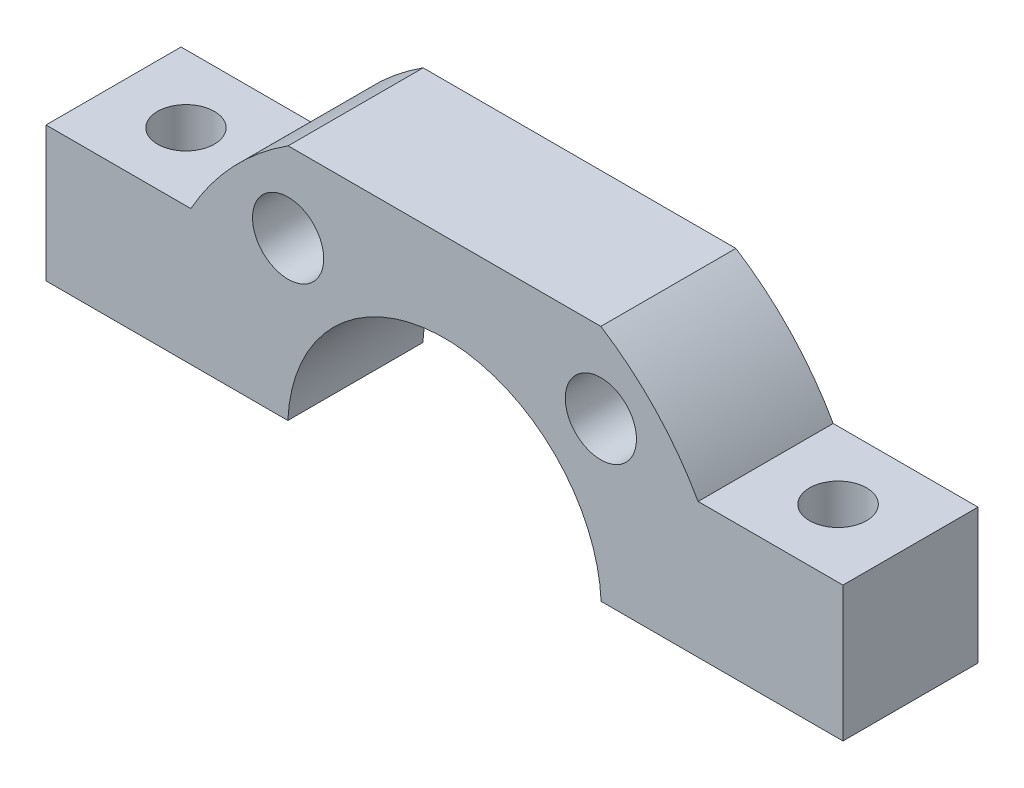
ISO-10303-21;
HEADER;
FILE_DESCRIPTION(('STEP AP214'),'2;1');
FILE_NAME('part.step','',(''),(''),'','','');
FILE_SCHEMA(('AUTOMOTIVE_DESIGN { 1 0 10303 214 1 1 1 1 }'));
ENDSEC;
DATA;
#1=APPLICATION_CONTEXT('core data for automotive mechanical design processes');
#2=APPLICATION_PROTOCOL_DEFINITION('international standard','automotive_design',2000,#1);
#3=PRODUCT_CONTEXT('',#1,'mechanical');
#4=PRODUCT('Part','Part','',(#3));
#5=PRODUCT_RELATED_PRODUCT_CATEGORY('part','',(#4));
#6=PRODUCT_DEFINITION_FORMATION('','',#4);
#7=PRODUCT_DEFINITION_CONTEXT('part definition',#1,'design');
#8=PRODUCT_DEFINITION('design','',#6,#7);
#9=PRODUCT_DEFINITION_SHAPE('','',#8);
#10=(LENGTH_UNIT() NAMED_UNIT(*) SI_UNIT(.MILLI.,.METRE.));
#11=(NAMED_UNIT(*) PLANE_ANGLE_UNIT() SI_UNIT($,.RADIAN.));
#12=(NAMED_UNIT(*) SI_UNIT($,.STERADIAN.) SOLID_ANGLE_UNIT());
#13=UNCERTAINTY_MEASURE_WITH_UNIT(LENGTH_MEASURE(1.E-05),#10,'distance_accuracy_value','');
#14=(GEOMETRIC_REPRESENTATION_CONTEXT(3) GLOBAL_UNCERTAINTY_ASSIGNED_CONTEXT((#13)) GLOBAL_UNIT_ASSIGNED_CONTEXT((#10,
#11,#12)) REPRESENTATION_CONTEXT('',''));
#15=CARTESIAN_POINT('',(0.,0.,0.));
#16=DIRECTION('',(0.,0.,1.));
#17=DIRECTION('',(1.,0.,0.));
#18=AXIS2_PLACEMENT_3D('',#15,#16,#17);
#19=CARTESIAN_POINT('',(0.,0.,9.5));
#20=DIRECTION('',(0.,0.,1.));
#21=DIRECTION('',(1.,0.,0.));
#22=AXIS2_PLACEMENT_3D('',#19,#20,#21);
#23=PLANE('',#22);
#24=CARTESIAN_POINT('',(11.,11.6189500386223,9.5));
#25=DIRECTION('',(0.,0.,1.));
#26=DIRECTION('',(1.,0.,0.));
#27=AXIS2_PLACEMENT_3D('',#24,#25,#26);
#28=CIRCLE('',#27,2.505);
#29=CARTESIAN_POINT('',(13.505,11.6189500386223,9.5));
#30=VERTEX_POINT('',#29);
#31=EDGE_CURVE('E191',#30,#30,#28,.T.);
#32=ORIENTED_EDGE('',*,*,#31,.F.);
#33=EDGE_LOOP('',(#32));
#34=FACE_BOUND('',#33,.T.);
#35=CARTESIAN_POINT('',(-11.,11.6189500386223,9.5));
#36=DIRECTION('',(0.,0.,1.));
#37=DIRECTION('',(1.,0.,0.));
#38=AXIS2_PLACEMENT_3D('',#35,#36,#37);
#39=CIRCLE('',#38,2.505);
#40=CARTESIAN_POINT('',(-8.495,11.6189500386223,9.5));
#41=VERTEX_POINT('',#40);
#42=EDGE_CURVE('E251',#41,#41,#39,.T.);
#43=ORIENTED_EDGE('',*,*,#42,.F.);
#44=EDGE_LOOP('',(#43));
#45=FACE_BOUND('',#44,.T.);
#46=DIRECTION('',(0.,-1.,0.));
#47=VECTOR('',#46,1.);
#48=CARTESIAN_POINT('',(-28.03,0.,9.5));
#49=LINE('',#48,#47);
#50=CARTESIAN_POINT('',(-28.03,10.,9.5));
#51=VERTEX_POINT('',#50);
#52=CARTESIAN_POINT('',(-28.03,0.5,9.5));
#53=VERTEX_POINT('',#52);
#54=EDGE_CURVE('E143',#51,#53,#49,.T.);
#55=ORIENTED_EDGE('',*,*,#54,.T.);
#56=DIRECTION('',(1.,0.,0.));
#57=VECTOR('',#56,1.);
#58=CARTESIAN_POINT('',(0.,0.5,9.5));
#59=LINE('',#58,#57);
#60=CARTESIAN_POINT('',(-11.0186614432062,0.5,9.5));
#61=VERTEX_POINT('',#60);
#62=EDGE_CURVE('E56',#53,#61,#59,.T.);
#63=ORIENTED_EDGE('',*,*,#62,.T.);
#64=CARTESIAN_POINT('',(0.,0.,9.5));
#65=DIRECTION('',(0.,0.,-1.));
#66=DIRECTION('',(1.,0.,0.));
#67=AXIS2_PLACEMENT_3D('',#64,#65,#66);
#68=CIRCLE('',#67,11.03);
#69=CARTESIAN_POINT('',(11.0186614432062,0.5,9.5));
#70=VERTEX_POINT('',#69);
#71=EDGE_CURVE('E131',#61,#70,#68,.T.);
#72=ORIENTED_EDGE('',*,*,#71,.T.);
#73=CARTESIAN_POINT('',(28.03,0.5,9.5));
#74=VERTEX_POINT('',#73);
#75=EDGE_CURVE('E247',#70,#74,#59,.T.);
#76=ORIENTED_EDGE('',*,*,#75,.T.);
#77=DIRECTION('',(0.,1.,0.));
#78=VECTOR('',#77,1.);
#79=CARTESIAN_POINT('',(28.03,0.,9.5));
#80=LINE('',#79,#78);
#81=CARTESIAN_POINT('',(28.03,10.,9.5));
#82=VERTEX_POINT('',#81);
#83=EDGE_CURVE('E135',#74,#82,#80,.T.);
#84=ORIENTED_EDGE('',*,*,#83,.T.);
#85=DIRECTION('',(-1.,0.,0.));
#86=VECTOR('',#85,1.);
#87=CARTESIAN_POINT('',(28.03,10.,9.5));
#88=LINE('',#87,#86);
#89=CARTESIAN_POINT('',(17.8428878183517,10.,9.5));
#90=VERTEX_POINT('',#89);
#91=EDGE_CURVE('E198',#82,#90,#88,.T.);
#92=ORIENTED_EDGE('',*,*,#91,.T.);
#93=CARTESIAN_POINT('',(0.,0.,9.5));
#94=DIRECTION('',(0.,0.,1.));
#95=DIRECTION('',(-1.,0.,0.));
#96=AXIS2_PLACEMENT_3D('',#93,#94,#95);
#97=CIRCLE('',#96,20.4540618386247);
#98=CARTESIAN_POINT('',(11.,17.2443801192819,9.5));
#99=VERTEX_POINT('',#98);
#100=EDGE_CURVE('E160',#90,#99,#97,.T.);
#101=ORIENTED_EDGE('',*,*,#100,.T.);
#102=DIRECTION('',(-1.,0.,0.));
#103=VECTOR('',#102,1.);
#104=CARTESIAN_POINT('',(-11.,17.2443801192819,9.5));
#105=LINE('',#104,#103);
#106=CARTESIAN_POINT('',(-11.,17.2443801192819,9.5));
#107=VERTEX_POINT('',#106);
#108=EDGE_CURVE('E187',#99,#107,#105,.T.);
#109=ORIENTED_EDGE('',*,*,#108,.T.);
#110=CARTESIAN_POINT('',(0.,0.,9.5));
#111=DIRECTION('',(0.,0.,1.));
#112=DIRECTION('',(-1.,0.,0.));
#113=AXIS2_PLACEMENT_3D('',#110,#111,#112);
#114=CIRCLE('',#113,20.4540618386247);
#115=CARTESIAN_POINT('',(-17.8428878183517,10.,9.5));
#116=VERTEX_POINT('',#115);
#117=EDGE_CURVE('E184',#107,#116,#114,.T.);
#118=ORIENTED_EDGE('',*,*,#117,.T.);
#119=DIRECTION('',(-1.,0.,0.));
#120=VECTOR('',#119,1.);
#121=CARTESIAN_POINT('',(-28.03,10.,9.5));
#122=LINE('',#121,#120);
#123=EDGE_CURVE('E182',#116,#51,#122,.T.);
#124=ORIENTED_EDGE('',*,*,#123,.T.);
#125=EDGE_LOOP('',(#55,#63,#72,#76,#84,#92,#101,#109,#118,#124));
#126=FACE_BOUND('',#125,.T.);
#127=ADVANCED_FACE('F32',(#34,#45,#126),#23,.T.);
#128=CARTESIAN_POINT('',(0.,0.,0.));
#129=DIRECTION('',(0.,0.,1.));
#130=DIRECTION('',(1.,0.,0.));
#131=AXIS2_PLACEMENT_3D('',#128,#129,#130);
#132=PLANE('',#131);
#133=CARTESIAN_POINT('',(11.,11.6189500386223,0.));
#134=DIRECTION('',(0.,0.,1.));
#135=DIRECTION('',(1.,0.,0.));
#136=AXIS2_PLACEMENT_3D('',#133,#134,#135);
#137=CIRCLE('',#136,2.505);
#138=CARTESIAN_POINT('',(13.505,11.6189500386223,0.));
#139=VERTEX_POINT('',#138);
#140=EDGE_CURVE('E254',#139,#139,#137,.T.);
#141=ORIENTED_EDGE('',*,*,#140,.T.);
#142=EDGE_LOOP('',(#141));
#143=FACE_BOUND('',#142,.T.);
#144=CARTESIAN_POINT('',(-11.,11.6189500386223,0.));
#145=DIRECTION('',(0.,0.,1.));
#146=DIRECTION('',(1.,0.,0.));
#147=AXIS2_PLACEMENT_3D('',#144,#145,#146);
#148=CIRCLE('',#147,2.505);
#149=CARTESIAN_POINT('',(-8.495,11.6189500386223,0.));
#150=VERTEX_POINT('',#149);
#151=EDGE_CURVE('E245',#150,#150,#148,.T.);
#152=ORIENTED_EDGE('',*,*,#151,.T.);
#153=EDGE_LOOP('',(#152));
#154=FACE_BOUND('',#153,.T.);
#155=DIRECTION('',(1.,0.,0.));
#156=VECTOR('',#155,1.);
#157=CARTESIAN_POINT('',(0.,0.5,0.));
#158=LINE('',#157,#156);
#159=CARTESIAN_POINT('',(-28.03,0.5,0.));
#160=VERTEX_POINT('',#159);
#161=CARTESIAN_POINT('',(-11.0186614432062,0.5,0.));
#162=VERTEX_POINT('',#161);
#163=EDGE_CURVE('E110',#160,#162,#158,.T.);
#164=ORIENTED_EDGE('',*,*,#163,.F.);
#165=DIRECTION('',(0.,-1.,0.));
#166=VECTOR('',#165,1.);
#167=CARTESIAN_POINT('',(-28.03,0.,0.));
#168=LINE('',#167,#166);
#169=CARTESIAN_POINT('',(-28.03,10.,0.));
#170=VERTEX_POINT('',#169);
#171=EDGE_CURVE('E123',#170,#160,#168,.T.);
#172=ORIENTED_EDGE('',*,*,#171,.F.);
#173=DIRECTION('',(-1.,0.,0.));
#174=VECTOR('',#173,1.);
#175=CARTESIAN_POINT('',(-28.03,10.,0.));
#176=LINE('',#175,#174);
#177=CARTESIAN_POINT('',(-17.8428878183517,10.,0.));
#178=VERTEX_POINT('',#177);
#179=EDGE_CURVE('E132',#178,#170,#176,.T.);
#180=ORIENTED_EDGE('',*,*,#179,.F.);
#181=CARTESIAN_POINT('',(0.,0.,0.));
#182=DIRECTION('',(0.,0.,1.));
#183=DIRECTION('',(-1.,0.,0.));
#184=AXIS2_PLACEMENT_3D('',#181,#182,#183);
#185=CIRCLE('',#184,20.4540618386247);
#186=CARTESIAN_POINT('',(-11.,17.2443801192819,0.));
#187=VERTEX_POINT('',#186);
#188=EDGE_CURVE('E137',#187,#178,#185,.T.);
#189=ORIENTED_EDGE('',*,*,#188,.F.);
#190=DIRECTION('',(-1.,0.,0.));
#191=VECTOR('',#190,1.);
#192=CARTESIAN_POINT('',(-11.,17.2443801192819,0.));
#193=LINE('',#192,#191);
#194=CARTESIAN_POINT('',(11.,17.2443801192819,0.));
#195=VERTEX_POINT('',#194);
#196=EDGE_CURVE('E168',#195,#187,#193,.T.);
#197=ORIENTED_EDGE('',*,*,#196,.F.);
#198=CARTESIAN_POINT('',(0.,0.,0.));
#199=DIRECTION('',(0.,0.,1.));
#200=DIRECTION('',(-1.,0.,0.));
#201=AXIS2_PLACEMENT_3D('',#198,#199,#200);
#202=CIRCLE('',#201,20.4540618386247);
#203=CARTESIAN_POINT('',(17.8428878183517,10.,0.));
#204=VERTEX_POINT('',#203);
#205=EDGE_CURVE('E159',#204,#195,#202,.T.);
#206=ORIENTED_EDGE('',*,*,#205,.F.);
#207=DIRECTION('',(-1.,0.,0.));
#208=VECTOR('',#207,1.);
#209=CARTESIAN_POINT('',(28.03,10.,0.));
#210=LINE('',#209,#208);
#211=CARTESIAN_POINT('',(28.03,10.,0.));
#212=VERTEX_POINT('',#211);
#213=EDGE_CURVE('E166',#212,#204,#210,.T.);
#214=ORIENTED_EDGE('',*,*,#213,.F.);
#215=DIRECTION('',(0.,1.,0.));
#216=VECTOR('',#215,1.);
#217=CARTESIAN_POINT('',(28.03,0.,0.));
#218=LINE('',#217,#216);
#219=CARTESIAN_POINT('',(28.03,0.5,0.));
#220=VERTEX_POINT('',#219);
#221=EDGE_CURVE('E171',#220,#212,#218,.T.);
#222=ORIENTED_EDGE('',*,*,#221,.F.);
#223=CARTESIAN_POINT('',(11.0186614432062,0.5,0.));
#224=VERTEX_POINT('',#223);
#225=EDGE_CURVE('E48',#224,#220,#158,.T.);
#226=ORIENTED_EDGE('',*,*,#225,.F.);
#227=CARTESIAN_POINT('',(0.,0.,0.));
#228=DIRECTION('',(0.,0.,-1.));
#229=DIRECTION('',(1.,0.,0.));
#230=AXIS2_PLACEMENT_3D('',#227,#228,#229);
#231=CIRCLE('',#230,11.03);
#232=EDGE_CURVE('E125',#162,#224,#231,.T.);
#233=ORIENTED_EDGE('',*,*,#232,.F.);
#234=EDGE_LOOP('',(#164,#172,#180,#189,#197,#206,#214,#222,#226,#233));
#235=FACE_BOUND('',#234,.T.);
#236=ADVANCED_FACE('F121',(#143,#154,#235),#132,.F.);
#237=CARTESIAN_POINT('',(0.,0.,9.5));
#238=DIRECTION('',(0.,0.,-1.));
#239=DIRECTION('',(-1.,0.,0.));
#240=AXIS2_PLACEMENT_3D('',#237,#238,#239);
#241=CYLINDRICAL_SURFACE('',#240,11.03);
#242=DIRECTION('',(0.,0.,-1.));
#243=VECTOR('',#242,1.);
#244=CARTESIAN_POINT('',(-11.0186614432062,0.5,9.5));
#245=LINE('',#244,#243);
#246=EDGE_CURVE('E289',#162,#61,#245,.F.);
#247=ORIENTED_EDGE('',*,*,#246,.F.);
#248=ORIENTED_EDGE('',*,*,#232,.T.);
#249=DIRECTION('',(0.,0.,-1.));
#250=VECTOR('',#249,1.);
#251=CARTESIAN_POINT('',(11.0186614432062,0.5,9.5));
#252=LINE('',#251,#250);
#253=EDGE_CURVE('E242',#70,#224,#252,.T.);
#254=ORIENTED_EDGE('',*,*,#253,.F.);
#255=ORIENTED_EDGE('',*,*,#71,.F.);
#256=EDGE_LOOP('',(#247,#248,#254,#255));
#257=FACE_BOUND('',#256,.T.);
#258=ADVANCED_FACE('F34',(#257),#241,.F.);
#259=CARTESIAN_POINT('',(28.03,0.,9.5));
#260=DIRECTION('',(-1.,0.,0.));
#261=DIRECTION('',(0.,-1.,0.));
#262=AXIS2_PLACEMENT_3D('',#259,#260,#261);
#263=PLANE('',#262);
#264=DIRECTION('',(0.,0.,1.));
#265=VECTOR('',#264,1.);
#266=CARTESIAN_POINT('',(28.03,0.5,9.5));
#267=LINE('',#266,#265);
#268=EDGE_CURVE('E196',#220,#74,#267,.T.);
#269=ORIENTED_EDGE('',*,*,#268,.F.);
#270=ORIENTED_EDGE('',*,*,#221,.T.);
#271=DIRECTION('',(0.,0.,-1.));
#272=VECTOR('',#271,1.);
#273=CARTESIAN_POINT('',(28.03,10.,9.5));
#274=LINE('',#273,#272);
#275=EDGE_CURVE('E11',#82,#212,#274,.T.);
#276=ORIENTED_EDGE('',*,*,#275,.F.);
#277=ORIENTED_EDGE('',*,*,#83,.F.);
#278=EDGE_LOOP('',(#269,#270,#276,#277));
#279=FACE_BOUND('',#278,.T.);
#280=ADVANCED_FACE('F194',(#279),#263,.F.);
#281=CARTESIAN_POINT('',(-28.03,0.,9.5));
#282=DIRECTION('',(1.,0.,0.));
#283=DIRECTION('',(0.,1.,0.));
#284=AXIS2_PLACEMENT_3D('',#281,#282,#283);
#285=PLANE('',#284);
#286=DIRECTION('',(0.,0.,-1.));
#287=VECTOR('',#286,1.);
#288=CARTESIAN_POINT('',(-28.03,0.5,9.5));
#289=LINE('',#288,#287);
#290=EDGE_CURVE('E107',#53,#160,#289,.T.);
#291=ORIENTED_EDGE('',*,*,#290,.F.);
#292=ORIENTED_EDGE('',*,*,#54,.F.);
#293=DIRECTION('',(0.,0.,-1.));
#294=VECTOR('',#293,1.);
#295=CARTESIAN_POINT('',(-28.03,10.,9.5));
#296=LINE('',#295,#294);
#297=EDGE_CURVE('E130',#51,#170,#296,.T.);
#298=ORIENTED_EDGE('',*,*,#297,.T.);
#299=ORIENTED_EDGE('',*,*,#171,.T.);
#300=EDGE_LOOP('',(#291,#292,#298,#299));
#301=FACE_BOUND('',#300,.T.);
#302=ADVANCED_FACE('F128',(#301),#285,.F.);
#303=CARTESIAN_POINT('',(22.9364439091759,-0.00100000000000447,4.75));
#304=DIRECTION('',(0.,1.,0.));
#305=DIRECTION('',(-1.,0.,0.));
#306=AXIS2_PLACEMENT_3D('',#303,#304,#305);
#307=CYLINDRICAL_SURFACE('',#306,2.005);
#308=CARTESIAN_POINT('',(22.9364439091759,10.,4.75));
#309=DIRECTION('',(0.,1.,0.));
#310=DIRECTION('',(-1.,0.,0.));
#311=AXIS2_PLACEMENT_3D('',#308,#309,#310);
#312=CIRCLE('',#311,2.005);
#313=CARTESIAN_POINT('',(20.9314439091759,10.,4.75));
#314=VERTEX_POINT('',#313);
#315=EDGE_CURVE('E241',#314,#314,#312,.T.);
#316=ORIENTED_EDGE('',*,*,#315,.T.);
#317=EDGE_LOOP('',(#316));
#318=FACE_BOUND('',#317,.T.);
#319=CARTESIAN_POINT('',(22.9364439091759,0.5,4.75));
#320=DIRECTION('',(0.,-1.,0.));
#321=DIRECTION('',(0.,0.,-1.));
#322=AXIS2_PLACEMENT_3D('',#319,#320,#321);
#323=CIRCLE('',#322,2.005);
#324=CARTESIAN_POINT('',(22.9364439091759,0.5,2.745));
#325=VERTEX_POINT('',#324);
#326=EDGE_CURVE('E116',#325,#325,#323,.F.);
#327=ORIENTED_EDGE('',*,*,#326,.F.);
#328=EDGE_LOOP('',(#327));
#329=FACE_BOUND('',#328,.T.);
#330=ADVANCED_FACE('F229',(#318,#329),#307,.F.);
#331=CARTESIAN_POINT('',(-22.9364439091759,-0.00100000000001488,4.75));
#332=DIRECTION('',(0.,1.,0.));
#333=DIRECTION('',(-1.,0.,0.));
#334=AXIS2_PLACEMENT_3D('',#331,#332,#333);
#335=CYLINDRICAL_SURFACE('',#334,2.);
#336=CARTESIAN_POINT('',(-22.9364439091759,9.99999999999999,4.75));
#337=DIRECTION('',(0.,1.,0.));
#338=DIRECTION('',(-1.,0.,0.));
#339=AXIS2_PLACEMENT_3D('',#336,#337,#338);
#340=CIRCLE('',#339,2.);
#341=CARTESIAN_POINT('',(-24.9364439091759,9.99999999999999,4.75));
#342=VERTEX_POINT('',#341);
#343=EDGE_CURVE('E239',#342,#342,#340,.T.);
#344=ORIENTED_EDGE('',*,*,#343,.T.);
#345=EDGE_LOOP('',(#344));
#346=FACE_BOUND('',#345,.T.);
#347=CARTESIAN_POINT('',(-22.9364439091759,0.5,4.75));
#348=DIRECTION('',(0.,-1.,0.));
#349=DIRECTION('',(0.,0.,-1.));
#350=AXIS2_PLACEMENT_3D('',#347,#348,#349);
#351=CIRCLE('',#350,2.);
#352=CARTESIAN_POINT('',(-22.9364439091759,0.5,2.75));
#353=VERTEX_POINT('',#352);
#354=EDGE_CURVE('E36',#353,#353,#351,.F.);
#355=ORIENTED_EDGE('',*,*,#354,.F.);
#356=EDGE_LOOP('',(#355));
#357=FACE_BOUND('',#356,.T.);
#358=ADVANCED_FACE('F276',(#346,#357),#335,.F.);
#359=CARTESIAN_POINT('',(28.03,10.,9.5));
#360=DIRECTION('',(0.,-1.,0.));
#361=DIRECTION('',(0.,0.,-1.));
#362=AXIS2_PLACEMENT_3D('',#359,#360,#361);
#363=PLANE('',#362);
#364=ORIENTED_EDGE('',*,*,#315,.F.);
#365=EDGE_LOOP('',(#364));
#366=FACE_BOUND('',#365,.T.);
#367=ORIENTED_EDGE('',*,*,#213,.T.);
#368=DIRECTION('',(0.,0.,-1.));
#369=VECTOR('',#368,1.);
#370=CARTESIAN_POINT('',(17.8428878183517,10.,9.5));
#371=LINE('',#370,#369);
#372=EDGE_CURVE('E41',#90,#204,#371,.T.);
#373=ORIENTED_EDGE('',*,*,#372,.F.);
#374=ORIENTED_EDGE('',*,*,#91,.F.);
#375=ORIENTED_EDGE('',*,*,#275,.T.);
#376=EDGE_LOOP('',(#367,#373,#374,#375));
#377=FACE_BOUND('',#376,.T.);
#378=ADVANCED_FACE('F197',(#366,#377),#363,.F.);
#379=CARTESIAN_POINT('',(0.,0.,9.5));
#380=DIRECTION('',(0.,0.,-1.));
#381=DIRECTION('',(-1.,0.,0.));
#382=AXIS2_PLACEMENT_3D('',#379,#380,#381);
#383=CYLINDRICAL_SURFACE('',#382,20.4540618386247);
#384=ORIENTED_EDGE('',*,*,#205,.T.);
#385=DIRECTION('',(0.,0.,-1.));
#386=VECTOR('',#385,1.);
#387=CARTESIAN_POINT('',(11.,17.2443801192819,9.5));
#388=LINE('',#387,#386);
#389=EDGE_CURVE('E149',#99,#195,#388,.T.);
#390=ORIENTED_EDGE('',*,*,#389,.F.);
#391=ORIENTED_EDGE('',*,*,#100,.F.);
#392=ORIENTED_EDGE('',*,*,#372,.T.);
#393=EDGE_LOOP('',(#384,#390,#391,#392));
#394=FACE_BOUND('',#393,.T.);
#395=ADVANCED_FACE('F157',(#394),#383,.T.);
#396=CARTESIAN_POINT('',(-11.,17.2443801192819,9.5));
#397=DIRECTION('',(0.,-1.,0.));
#398=DIRECTION('',(1.,0.,0.));
#399=AXIS2_PLACEMENT_3D('',#396,#397,#398);
#400=PLANE('',#399);
#401=ORIENTED_EDGE('',*,*,#196,.T.);
#402=DIRECTION('',(0.,0.,-1.));
#403=VECTOR('',#402,1.);
#404=CARTESIAN_POINT('',(-11.,17.2443801192819,9.5));
#405=LINE('',#404,#403);
#406=EDGE_CURVE('E146',#107,#187,#405,.T.);
#407=ORIENTED_EDGE('',*,*,#406,.F.);
#408=ORIENTED_EDGE('',*,*,#108,.F.);
#409=ORIENTED_EDGE('',*,*,#389,.T.);
#410=EDGE_LOOP('',(#401,#407,#408,#409));
#411=FACE_BOUND('',#410,.T.);
#412=ADVANCED_FACE('F204',(#411),#400,.F.);
#413=CARTESIAN_POINT('',(0.,0.,9.5));
#414=DIRECTION('',(0.,0.,-1.));
#415=DIRECTION('',(-1.,0.,0.));
#416=AXIS2_PLACEMENT_3D('',#413,#414,#415);
#417=CYLINDRICAL_SURFACE('',#416,20.4540618386247);
#418=ORIENTED_EDGE('',*,*,#188,.T.);
#419=DIRECTION('',(0.,0.,-1.));
#420=VECTOR('',#419,1.);
#421=CARTESIAN_POINT('',(-17.8428878183517,10.,9.5));
#422=LINE('',#421,#420);
#423=EDGE_CURVE('E142',#116,#178,#422,.T.);
#424=ORIENTED_EDGE('',*,*,#423,.F.);
#425=ORIENTED_EDGE('',*,*,#117,.F.);
#426=ORIENTED_EDGE('',*,*,#406,.T.);
#427=EDGE_LOOP('',(#418,#424,#425,#426));
#428=FACE_BOUND('',#427,.T.);
#429=ADVANCED_FACE('F176',(#428),#417,.T.);
#430=CARTESIAN_POINT('',(-28.03,10.,9.5));
#431=DIRECTION('',(0.,-1.,0.));
#432=DIRECTION('',(0.,0.,-1.));
#433=AXIS2_PLACEMENT_3D('',#430,#431,#432);
#434=PLANE('',#433);
#435=ORIENTED_EDGE('',*,*,#343,.F.);
#436=EDGE_LOOP('',(#435));
#437=FACE_BOUND('',#436,.T.);
#438=ORIENTED_EDGE('',*,*,#179,.T.);
#439=ORIENTED_EDGE('',*,*,#297,.F.);
#440=ORIENTED_EDGE('',*,*,#123,.F.);
#441=ORIENTED_EDGE('',*,*,#423,.T.);
#442=EDGE_LOOP('',(#438,#439,#440,#441));
#443=FACE_BOUND('',#442,.T.);
#444=ADVANCED_FACE('F181',(#437,#443),#434,.F.);
#445=CARTESIAN_POINT('',(11.,11.6189500386223,9.5));
#446=DIRECTION('',(0.,0.,-1.));
#447=DIRECTION('',(-1.,0.,0.));
#448=AXIS2_PLACEMENT_3D('',#445,#446,#447);
#449=CYLINDRICAL_SURFACE('',#448,2.505);
#450=ORIENTED_EDGE('',*,*,#31,.T.);
#451=EDGE_LOOP('',(#450));
#452=FACE_BOUND('',#451,.T.);
#453=ORIENTED_EDGE('',*,*,#140,.F.);
#454=EDGE_LOOP('',(#453));
#455=FACE_BOUND('',#454,.T.);
#456=ADVANCED_FACE('F224',(#452,#455),#449,.F.);
#457=CARTESIAN_POINT('',(-11.,11.6189500386223,9.5));
#458=DIRECTION('',(0.,0.,-1.));
#459=DIRECTION('',(-1.,0.,0.));
#460=AXIS2_PLACEMENT_3D('',#457,#458,#459);
#461=CYLINDRICAL_SURFACE('',#460,2.505);
#462=ORIENTED_EDGE('',*,*,#42,.T.);
#463=EDGE_LOOP('',(#462));
#464=FACE_BOUND('',#463,.T.);
#465=ORIENTED_EDGE('',*,*,#151,.F.);
#466=EDGE_LOOP('',(#465));
#467=FACE_BOUND('',#466,.T.);
#468=ADVANCED_FACE('F235',(#464,#467),#461,.F.);
#469=CARTESIAN_POINT('',(0.,0.5,0.));
#470=DIRECTION('',(0.,-1.,0.));
#471=DIRECTION('',(0.,0.,-1.));
#472=AXIS2_PLACEMENT_3D('',#469,#470,#471);
#473=PLANE('',#472);
#474=ORIENTED_EDGE('',*,*,#354,.T.);
#475=EDGE_LOOP('',(#474));
#476=FACE_BOUND('',#475,.T.);
#477=ORIENTED_EDGE('',*,*,#246,.T.);
#478=ORIENTED_EDGE('',*,*,#62,.F.);
#479=ORIENTED_EDGE('',*,*,#290,.T.);
#480=ORIENTED_EDGE('',*,*,#163,.T.);
#481=EDGE_LOOP('',(#477,#478,#479,#480));
#482=FACE_BOUND('',#481,.T.);
#483=ADVANCED_FACE('F109',(#476,#482),#473,.T.);
#484=ORIENTED_EDGE('',*,*,#326,.T.);
#485=EDGE_LOOP('',(#484));
#486=FACE_BOUND('',#485,.T.);
#487=ORIENTED_EDGE('',*,*,#253,.T.);
#488=ORIENTED_EDGE('',*,*,#225,.T.);
#489=ORIENTED_EDGE('',*,*,#268,.T.);
#490=ORIENTED_EDGE('',*,*,#75,.F.);
#491=EDGE_LOOP('',(#487,#488,#489,#490));
#492=FACE_BOUND('',#491,.T.);
#493=ADVANCED_FACE('F270',(#486,#492),#473,.T.);
#494=CLOSED_SHELL('',(#127,#236,#258,#280,#302,#330,#358,#378,#395,#412,#429,#444,#456,#468,
#483,#493));
#495=MANIFOLD_SOLID_BREP('B2',#494);
#496=ADVANCED_BREP_SHAPE_REPRESENTATION('',(#18,#495),#14);
#497=SHAPE_DEFINITION_REPRESENTATION(#9,#496);
ENDSEC;
END-ISO-10303-21;
